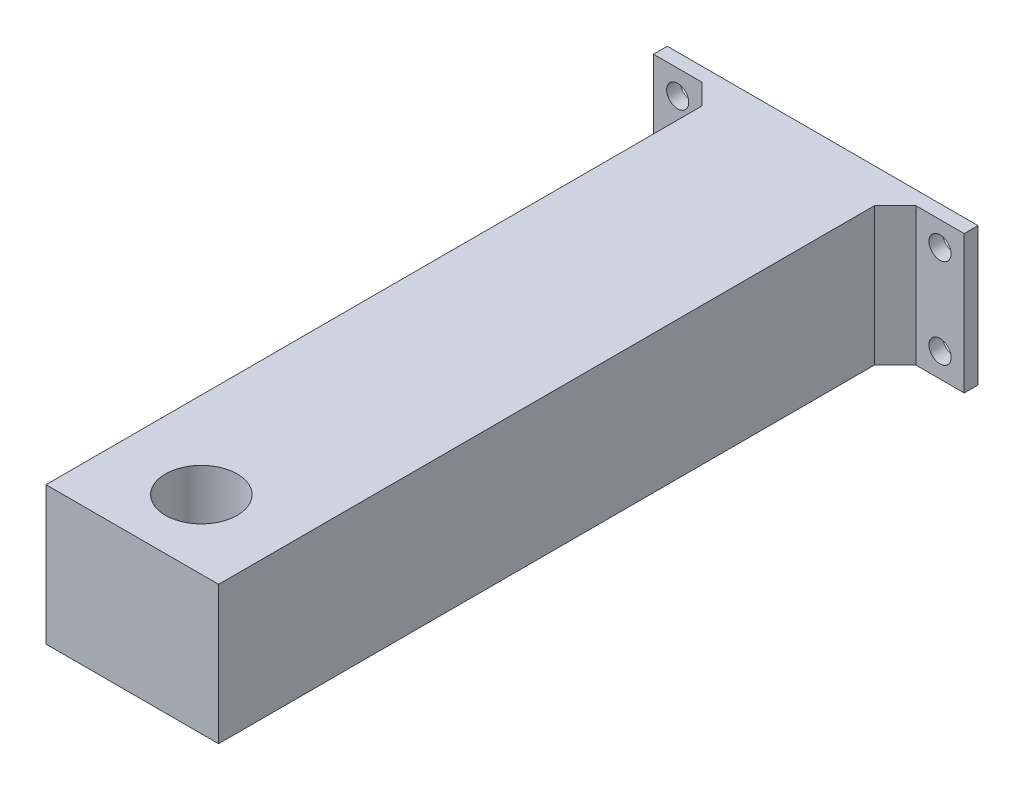
ISO-10303-21;
HEADER;
FILE_DESCRIPTION(('STEP AP214'),'2;1');
FILE_NAME('part.step','',(''),(''),'','','');
FILE_SCHEMA(('AUTOMOTIVE_DESIGN { 1 0 10303 214 1 1 1 1 }'));
ENDSEC;
DATA;
#1=APPLICATION_CONTEXT('core data for automotive mechanical design processes');
#2=APPLICATION_PROTOCOL_DEFINITION('international standard','automotive_design',2000,#1);
#3=PRODUCT_CONTEXT('',#1,'mechanical');
#4=PRODUCT('Part','Part','',(#3));
#5=PRODUCT_RELATED_PRODUCT_CATEGORY('part','',(#4));
#6=PRODUCT_DEFINITION_FORMATION('','',#4);
#7=PRODUCT_DEFINITION_CONTEXT('part definition',#1,'design');
#8=PRODUCT_DEFINITION('design','',#6,#7);
#9=PRODUCT_DEFINITION_SHAPE('','',#8);
#10=(LENGTH_UNIT() NAMED_UNIT(*) SI_UNIT(.MILLI.,.METRE.));
#11=(NAMED_UNIT(*) PLANE_ANGLE_UNIT() SI_UNIT($,.RADIAN.));
#12=(NAMED_UNIT(*) SI_UNIT($,.STERADIAN.) SOLID_ANGLE_UNIT());
#13=UNCERTAINTY_MEASURE_WITH_UNIT(LENGTH_MEASURE(1.E-05),#10,'distance_accuracy_value','');
#14=(GEOMETRIC_REPRESENTATION_CONTEXT(3) GLOBAL_UNCERTAINTY_ASSIGNED_CONTEXT((#13)) GLOBAL_UNIT_ASSIGNED_CONTEXT((#10,
#11,#12)) REPRESENTATION_CONTEXT('',''));
#15=CARTESIAN_POINT('',(0.,0.,0.));
#16=DIRECTION('',(0.,0.,1.));
#17=DIRECTION('',(1.,0.,0.));
#18=AXIS2_PLACEMENT_3D('',#15,#16,#17);
#19=CARTESIAN_POINT('',(-12.7289446195248,5.19153225806452,100.));
#20=DIRECTION('',(1.,0.,0.));
#21=DIRECTION('',(0.,0.,-1.));
#22=AXIS2_PLACEMENT_3D('',#19,#20,#21);
#23=PLANE('',#22);
#24=DIRECTION('',(0.,0.,-1.));
#25=VECTOR('',#24,1.);
#26=CARTESIAN_POINT('',(-12.7289446195248,5.19153225806452,100.));
#27=LINE('',#26,#25);
#28=CARTESIAN_POINT('',(-12.7289446195248,5.19153225806452,100.));
#29=VERTEX_POINT('',#28);
#30=CARTESIAN_POINT('',(-12.7289446195248,5.19153225806452,5.));
#31=VERTEX_POINT('',#30);
#32=EDGE_CURVE('E51',#29,#31,#27,.T.);
#33=ORIENTED_EDGE('',*,*,#32,.T.);
#34=DIRECTION('',(0.,-1.,0.));
#35=VECTOR('',#34,1.);
#36=CARTESIAN_POINT('',(-12.7289446195248,5.19153225806452,5.));
#37=LINE('',#36,#35);
#38=CARTESIAN_POINT('',(-12.7289446195248,-14.8084677419355,5.));
#39=VERTEX_POINT('',#38);
#40=EDGE_CURVE('E47',#31,#39,#37,.T.);
#41=ORIENTED_EDGE('',*,*,#40,.T.);
#42=DIRECTION('',(0.,0.,-1.));
#43=VECTOR('',#42,1.);
#44=CARTESIAN_POINT('',(-12.7289446195248,-14.8084677419355,100.));
#45=LINE('',#44,#43);
#46=CARTESIAN_POINT('',(-12.7289446195248,-14.8084677419355,100.));
#47=VERTEX_POINT('',#46);
#48=EDGE_CURVE('E11',#47,#39,#45,.T.);
#49=ORIENTED_EDGE('',*,*,#48,.F.);
#50=DIRECTION('',(0.,-1.,0.));
#51=VECTOR('',#50,1.);
#52=CARTESIAN_POINT('',(-12.7289446195248,5.19153225806452,100.));
#53=LINE('',#52,#51);
#54=EDGE_CURVE('E186',#29,#47,#53,.T.);
#55=ORIENTED_EDGE('',*,*,#54,.F.);
#56=EDGE_LOOP('',(#33,#41,#49,#55));
#57=FACE_BOUND('',#56,.T.);
#58=ADVANCED_FACE('F33',(#57),#23,.F.);
#59=CARTESIAN_POINT('',(12.2710553804752,5.19153225806452,100.));
#60=DIRECTION('',(-1.,0.,0.));
#61=DIRECTION('',(0.,-1.,0.));
#62=AXIS2_PLACEMENT_3D('',#59,#60,#61);
#63=PLANE('',#62);
#64=DIRECTION('',(0.,0.,-1.));
#65=VECTOR('',#64,1.);
#66=CARTESIAN_POINT('',(12.2710553804752,-14.8084677419355,100.));
#67=LINE('',#66,#65);
#68=CARTESIAN_POINT('',(12.2710553804752,-14.8084677419355,100.));
#69=VERTEX_POINT('',#68);
#70=CARTESIAN_POINT('',(12.2710553804752,-14.8084677419355,5.));
#71=VERTEX_POINT('',#70);
#72=EDGE_CURVE('E40',#69,#71,#67,.T.);
#73=ORIENTED_EDGE('',*,*,#72,.T.);
#74=DIRECTION('',(0.,1.,0.));
#75=VECTOR('',#74,1.);
#76=CARTESIAN_POINT('',(12.2710553804752,-14.8084677419355,5.));
#77=LINE('',#76,#75);
#78=CARTESIAN_POINT('',(12.2710553804752,5.19153225806452,5.));
#79=VERTEX_POINT('',#78);
#80=EDGE_CURVE('E162',#71,#79,#77,.T.);
#81=ORIENTED_EDGE('',*,*,#80,.T.);
#82=DIRECTION('',(0.,0.,-1.));
#83=VECTOR('',#82,1.);
#84=CARTESIAN_POINT('',(12.2710553804752,5.19153225806452,100.));
#85=LINE('',#84,#83);
#86=CARTESIAN_POINT('',(12.2710553804752,5.19153225806452,100.));
#87=VERTEX_POINT('',#86);
#88=EDGE_CURVE('E197',#87,#79,#85,.T.);
#89=ORIENTED_EDGE('',*,*,#88,.F.);
#90=DIRECTION('',(0.,1.,0.));
#91=VECTOR('',#90,1.);
#92=CARTESIAN_POINT('',(12.2710553804752,5.19153225806452,100.));
#93=LINE('',#92,#91);
#94=EDGE_CURVE('E191',#69,#87,#93,.T.);
#95=ORIENTED_EDGE('',*,*,#94,.F.);
#96=EDGE_LOOP('',(#73,#81,#89,#95));
#97=FACE_BOUND('',#96,.T.);
#98=ADVANCED_FACE('F203',(#97),#63,.F.);
#99=CARTESIAN_POINT('',(-12.7289446195248,-14.8084677419355,100.));
#100=DIRECTION('',(0.,1.,0.));
#101=DIRECTION('',(0.,0.,1.));
#102=AXIS2_PLACEMENT_3D('',#99,#100,#101);
#103=PLANE('',#102);
#104=ORIENTED_EDGE('',*,*,#48,.T.);
#105=DIRECTION('',(-0.707106781186548,0.,-0.707106781186547));
#106=VECTOR('',#105,1.);
#107=CARTESIAN_POINT('',(-12.7289446195248,-14.8084677419355,5.));
#108=LINE('',#107,#106);
#109=CARTESIAN_POINT('',(-15.7289446195248,-14.8084677419355,2.));
#110=VERTEX_POINT('',#109);
#111=EDGE_CURVE('E223',#39,#110,#108,.T.);
#112=ORIENTED_EDGE('',*,*,#111,.T.);
#113=DIRECTION('',(1.,0.,0.));
#114=VECTOR('',#113,1.);
#115=CARTESIAN_POINT('',(-22.7289446195248,-14.8084677419355,2.));
#116=LINE('',#115,#114);
#117=CARTESIAN_POINT('',(-22.7289446195248,-14.8084677419355,2.));
#118=VERTEX_POINT('',#117);
#119=EDGE_CURVE('E125',#118,#110,#116,.T.);
#120=ORIENTED_EDGE('',*,*,#119,.F.);
#121=DIRECTION('',(0.,0.,1.));
#122=VECTOR('',#121,1.);
#123=CARTESIAN_POINT('',(-22.7289446195248,-14.8084677419355,0.));
#124=LINE('',#123,#122);
#125=CARTESIAN_POINT('',(-22.7289446195248,-14.8084677419355,0.));
#126=VERTEX_POINT('',#125);
#127=EDGE_CURVE('E122',#126,#118,#124,.T.);
#128=ORIENTED_EDGE('',*,*,#127,.F.);
#129=DIRECTION('',(1.,0.,0.));
#130=VECTOR('',#129,1.);
#131=CARTESIAN_POINT('',(-12.7289446195248,-14.8084677419355,0.));
#132=LINE('',#131,#130);
#133=CARTESIAN_POINT('',(22.2710553804752,-14.8084677419355,0.));
#134=VERTEX_POINT('',#133);
#135=EDGE_CURVE('E108',#126,#134,#132,.T.);
#136=ORIENTED_EDGE('',*,*,#135,.T.);
#137=DIRECTION('',(0.,0.,-1.));
#138=VECTOR('',#137,1.);
#139=CARTESIAN_POINT('',(22.2710553804752,-14.8084677419355,0.));
#140=LINE('',#139,#138);
#141=CARTESIAN_POINT('',(22.2710553804752,-14.8084677419355,2.));
#142=VERTEX_POINT('',#141);
#143=EDGE_CURVE('E174',#142,#134,#140,.T.);
#144=ORIENTED_EDGE('',*,*,#143,.F.);
#145=DIRECTION('',(-1.,0.,0.));
#146=VECTOR('',#145,1.);
#147=CARTESIAN_POINT('',(22.2710553804752,-14.8084677419355,2.));
#148=LINE('',#147,#146);
#149=CARTESIAN_POINT('',(15.2710553804752,-14.8084677419355,2.));
#150=VERTEX_POINT('',#149);
#151=EDGE_CURVE('E176',#142,#150,#148,.T.);
#152=ORIENTED_EDGE('',*,*,#151,.T.);
#153=DIRECTION('',(0.707106781186547,0.,-0.707106781186548));
#154=VECTOR('',#153,1.);
#155=CARTESIAN_POINT('',(12.2710553804752,-14.8084677419355,5.));
#156=LINE('',#155,#154);
#157=EDGE_CURVE('E159',#71,#150,#156,.T.);
#158=ORIENTED_EDGE('',*,*,#157,.F.);
#159=ORIENTED_EDGE('',*,*,#72,.F.);
#160=DIRECTION('',(1.,0.,0.));
#161=VECTOR('',#160,1.);
#162=CARTESIAN_POINT('',(-12.7289446195248,-14.8084677419355,100.));
#163=LINE('',#162,#161);
#164=EDGE_CURVE('E189',#47,#69,#163,.T.);
#165=ORIENTED_EDGE('',*,*,#164,.F.);
#166=EDGE_LOOP('',(#104,#112,#120,#128,#136,#144,#152,#158,#159,#165));
#167=FACE_BOUND('',#166,.T.);
#168=ADVANCED_FACE('F123',(#167),#103,.F.);
#169=CARTESIAN_POINT('',(-12.7289446195248,5.19153225806452,100.));
#170=DIRECTION('',(0.,-1.,0.));
#171=DIRECTION('',(0.,0.,-1.));
#172=AXIS2_PLACEMENT_3D('',#169,#170,#171);
#173=PLANE('',#172);
#174=DIRECTION('',(-0.707106781186548,0.,-0.707106781186547));
#175=VECTOR('',#174,1.);
#176=CARTESIAN_POINT('',(-12.7289446195248,5.19153225806452,5.));
#177=LINE('',#176,#175);
#178=CARTESIAN_POINT('',(-15.7289446195248,5.19153225806452,2.));
#179=VERTEX_POINT('',#178);
#180=EDGE_CURVE('E227',#31,#179,#177,.T.);
#181=ORIENTED_EDGE('',*,*,#180,.F.);
#182=ORIENTED_EDGE('',*,*,#32,.F.);
#183=DIRECTION('',(-1.,0.,0.));
#184=VECTOR('',#183,1.);
#185=CARTESIAN_POINT('',(-12.7289446195248,5.19153225806452,100.));
#186=LINE('',#185,#184);
#187=EDGE_CURVE('E193',#87,#29,#186,.T.);
#188=ORIENTED_EDGE('',*,*,#187,.F.);
#189=ORIENTED_EDGE('',*,*,#88,.T.);
#190=DIRECTION('',(0.707106781186547,0.,-0.707106781186548));
#191=VECTOR('',#190,1.);
#192=CARTESIAN_POINT('',(12.2710553804752,5.19153225806452,5.));
#193=LINE('',#192,#191);
#194=CARTESIAN_POINT('',(15.2710553804752,5.19153225806452,2.));
#195=VERTEX_POINT('',#194);
#196=EDGE_CURVE('E156',#79,#195,#193,.T.);
#197=ORIENTED_EDGE('',*,*,#196,.T.);
#198=DIRECTION('',(-1.,0.,0.));
#199=VECTOR('',#198,1.);
#200=CARTESIAN_POINT('',(22.2710553804752,5.19153225806452,2.));
#201=LINE('',#200,#199);
#202=CARTESIAN_POINT('',(22.2710553804752,5.19153225806452,2.));
#203=VERTEX_POINT('',#202);
#204=EDGE_CURVE('E179',#203,#195,#201,.T.);
#205=ORIENTED_EDGE('',*,*,#204,.F.);
#206=DIRECTION('',(0.,0.,1.));
#207=VECTOR('',#206,1.);
#208=CARTESIAN_POINT('',(22.2710553804752,5.19153225806452,0.));
#209=LINE('',#208,#207);
#210=CARTESIAN_POINT('',(22.2710553804752,5.19153225806452,0.));
#211=VERTEX_POINT('',#210);
#212=EDGE_CURVE('E170',#211,#203,#209,.T.);
#213=ORIENTED_EDGE('',*,*,#212,.F.);
#214=DIRECTION('',(-1.,0.,0.));
#215=VECTOR('',#214,1.);
#216=CARTESIAN_POINT('',(-12.7289446195248,5.19153225806452,0.));
#217=LINE('',#216,#215);
#218=CARTESIAN_POINT('',(-22.7289446195248,5.19153225806452,0.));
#219=VERTEX_POINT('',#218);
#220=EDGE_CURVE('E118',#211,#219,#217,.T.);
#221=ORIENTED_EDGE('',*,*,#220,.T.);
#222=DIRECTION('',(0.,0.,-1.));
#223=VECTOR('',#222,1.);
#224=CARTESIAN_POINT('',(-22.7289446195248,5.19153225806452,0.));
#225=LINE('',#224,#223);
#226=CARTESIAN_POINT('',(-22.7289446195248,5.19153225806452,2.));
#227=VERTEX_POINT('',#226);
#228=EDGE_CURVE('E133',#227,#219,#225,.T.);
#229=ORIENTED_EDGE('',*,*,#228,.F.);
#230=DIRECTION('',(1.,0.,0.));
#231=VECTOR('',#230,1.);
#232=CARTESIAN_POINT('',(-22.7289446195248,5.19153225806452,2.));
#233=LINE('',#232,#231);
#234=EDGE_CURVE('E142',#227,#179,#233,.T.);
#235=ORIENTED_EDGE('',*,*,#234,.T.);
#236=EDGE_LOOP('',(#181,#182,#188,#189,#197,#205,#213,#221,#229,#235));
#237=FACE_BOUND('',#236,.T.);
#238=CARTESIAN_POINT('',(-0.228944619524789,5.19153225806452,90.));
#239=DIRECTION('',(0.,1.,0.));
#240=DIRECTION('',(0.,0.,1.));
#241=AXIS2_PLACEMENT_3D('',#238,#239,#240);
#242=CIRCLE('',#241,5.2);
#243=CARTESIAN_POINT('',(-0.228944619524789,5.19153225806452,95.2));
#244=VERTEX_POINT('',#243);
#245=EDGE_CURVE('E181',#244,#244,#242,.T.);
#246=ORIENTED_EDGE('',*,*,#245,.F.);
#247=EDGE_LOOP('',(#246));
#248=FACE_BOUND('',#247,.T.);
#249=ADVANCED_FACE('F216',(#237,#248),#173,.F.);
#250=CARTESIAN_POINT('',(0.,0.,100.));
#251=DIRECTION('',(0.,0.,1.));
#252=DIRECTION('',(1.,0.,0.));
#253=AXIS2_PLACEMENT_3D('',#250,#251,#252);
#254=PLANE('',#253);
#255=ORIENTED_EDGE('',*,*,#54,.T.);
#256=ORIENTED_EDGE('',*,*,#164,.T.);
#257=ORIENTED_EDGE('',*,*,#94,.T.);
#258=ORIENTED_EDGE('',*,*,#187,.T.);
#259=EDGE_LOOP('',(#255,#256,#257,#258));
#260=FACE_BOUND('',#259,.T.);
#261=ADVANCED_FACE('F221',(#260),#254,.T.);
#262=CARTESIAN_POINT('',(0.,0.,0.));
#263=DIRECTION('',(0.,0.,1.));
#264=DIRECTION('',(1.,0.,0.));
#265=AXIS2_PLACEMENT_3D('',#262,#263,#264);
#266=PLANE('',#265);
#267=CARTESIAN_POINT('',(-19.2289446195248,1.69153225806452,0.));
#268=DIRECTION('',(0.,0.,1.));
#269=DIRECTION('',(1.,0.,0.));
#270=AXIS2_PLACEMENT_3D('',#267,#268,#269);
#271=CIRCLE('',#270,1.6);
#272=CARTESIAN_POINT('',(-17.6289446195248,1.69153225806452,0.));
#273=VERTEX_POINT('',#272);
#274=EDGE_CURVE('E236',#273,#273,#271,.T.);
#275=ORIENTED_EDGE('',*,*,#274,.T.);
#276=EDGE_LOOP('',(#275));
#277=FACE_BOUND('',#276,.T.);
#278=CARTESIAN_POINT('',(-19.2289446195248,-11.3084677419355,0.));
#279=DIRECTION('',(0.,0.,1.));
#280=DIRECTION('',(1.,0.,0.));
#281=AXIS2_PLACEMENT_3D('',#278,#279,#280);
#282=CIRCLE('',#281,1.6);
#283=CARTESIAN_POINT('',(-17.6289446195248,-11.3084677419355,0.));
#284=VERTEX_POINT('',#283);
#285=EDGE_CURVE('E228',#284,#284,#282,.T.);
#286=ORIENTED_EDGE('',*,*,#285,.T.);
#287=EDGE_LOOP('',(#286));
#288=FACE_BOUND('',#287,.T.);
#289=CARTESIAN_POINT('',(18.7710553804752,-11.3084677419355,0.));
#290=DIRECTION('',(0.,0.,1.));
#291=DIRECTION('',(1.,0.,0.));
#292=AXIS2_PLACEMENT_3D('',#289,#290,#291);
#293=CIRCLE('',#292,1.6);
#294=CARTESIAN_POINT('',(20.3710553804752,-11.3084677419355,0.));
#295=VERTEX_POINT('',#294);
#296=EDGE_CURVE('E147',#295,#295,#293,.T.);
#297=ORIENTED_EDGE('',*,*,#296,.T.);
#298=EDGE_LOOP('',(#297));
#299=FACE_BOUND('',#298,.T.);
#300=CARTESIAN_POINT('',(18.7710553804752,1.69153225806452,0.));
#301=DIRECTION('',(0.,0.,1.));
#302=DIRECTION('',(1.,0.,0.));
#303=AXIS2_PLACEMENT_3D('',#300,#301,#302);
#304=CIRCLE('',#303,1.6);
#305=CARTESIAN_POINT('',(20.3710553804752,1.69153225806452,0.));
#306=VERTEX_POINT('',#305);
#307=EDGE_CURVE('E153',#306,#306,#304,.T.);
#308=ORIENTED_EDGE('',*,*,#307,.T.);
#309=EDGE_LOOP('',(#308));
#310=FACE_BOUND('',#309,.T.);
#311=ORIENTED_EDGE('',*,*,#135,.F.);
#312=DIRECTION('',(0.,-1.,0.));
#313=VECTOR('',#312,1.);
#314=CARTESIAN_POINT('',(-22.7289446195248,-14.8084677419355,0.));
#315=LINE('',#314,#313);
#316=EDGE_CURVE('E112',#219,#126,#315,.T.);
#317=ORIENTED_EDGE('',*,*,#316,.F.);
#318=ORIENTED_EDGE('',*,*,#220,.F.);
#319=DIRECTION('',(0.,1.,0.));
#320=VECTOR('',#319,1.);
#321=CARTESIAN_POINT('',(22.2710553804752,5.19153225806452,0.));
#322=LINE('',#321,#320);
#323=EDGE_CURVE('E114',#134,#211,#322,.T.);
#324=ORIENTED_EDGE('',*,*,#323,.F.);
#325=EDGE_LOOP('',(#311,#317,#318,#324));
#326=FACE_BOUND('',#325,.T.);
#327=ADVANCED_FACE('F110',(#277,#288,#299,#310,#326),#266,.F.);
#328=CARTESIAN_POINT('',(-0.228944619524789,-2.80846774193548,90.));
#329=DIRECTION('',(0.,1.,0.));
#330=DIRECTION('',(0.,0.,1.));
#331=AXIS2_PLACEMENT_3D('',#328,#329,#330);
#332=CYLINDRICAL_SURFACE('',#331,5.2);
#333=CARTESIAN_POINT('',(-0.228944619524789,-2.80846774193548,90.));
#334=DIRECTION('',(0.,1.,0.));
#335=DIRECTION('',(0.,0.,1.));
#336=AXIS2_PLACEMENT_3D('',#333,#334,#335);
#337=CIRCLE('',#336,5.2);
#338=CARTESIAN_POINT('',(-0.228944619524789,-2.80846774193548,95.2));
#339=VERTEX_POINT('',#338);
#340=EDGE_CURVE('E119',#339,#339,#337,.T.);
#341=ORIENTED_EDGE('',*,*,#340,.F.);
#342=EDGE_LOOP('',(#341));
#343=FACE_BOUND('',#342,.T.);
#344=ORIENTED_EDGE('',*,*,#245,.T.);
#345=EDGE_LOOP('',(#344));
#346=FACE_BOUND('',#345,.T.);
#347=ADVANCED_FACE('F287',(#343,#346),#332,.F.);
#348=CARTESIAN_POINT('',(-0.228944619524789,-2.80846774193548,90.));
#349=DIRECTION('',(0.,1.,0.));
#350=DIRECTION('',(0.,0.,1.));
#351=AXIS2_PLACEMENT_3D('',#348,#349,#350);
#352=PLANE('',#351);
#353=ORIENTED_EDGE('',*,*,#340,.T.);
#354=EDGE_LOOP('',(#353));
#355=FACE_BOUND('',#354,.T.);
#356=ADVANCED_FACE('F271',(#355),#352,.T.);
#357=CARTESIAN_POINT('',(22.2710553804752,5.19153225806452,2.));
#358=DIRECTION('',(0.,0.,-1.));
#359=DIRECTION('',(0.,1.,0.));
#360=AXIS2_PLACEMENT_3D('',#357,#358,#359);
#361=PLANE('',#360);
#362=CARTESIAN_POINT('',(18.7710553804752,-11.3084677419355,2.));
#363=DIRECTION('',(0.,0.,1.));
#364=DIRECTION('',(1.,0.,0.));
#365=AXIS2_PLACEMENT_3D('',#362,#363,#364);
#366=CIRCLE('',#365,1.6);
#367=CARTESIAN_POINT('',(20.3710553804752,-11.3084677419355,2.));
#368=VERTEX_POINT('',#367);
#369=EDGE_CURVE('E146',#368,#368,#366,.T.);
#370=ORIENTED_EDGE('',*,*,#369,.F.);
#371=EDGE_LOOP('',(#370));
#372=FACE_BOUND('',#371,.T.);
#373=CARTESIAN_POINT('',(18.7710553804752,1.69153225806452,2.));
#374=DIRECTION('',(0.,0.,1.));
#375=DIRECTION('',(1.,0.,0.));
#376=AXIS2_PLACEMENT_3D('',#373,#374,#375);
#377=CIRCLE('',#376,1.6);
#378=CARTESIAN_POINT('',(20.3710553804752,1.69153225806452,2.));
#379=VERTEX_POINT('',#378);
#380=EDGE_CURVE('E150',#379,#379,#377,.T.);
#381=ORIENTED_EDGE('',*,*,#380,.F.);
#382=EDGE_LOOP('',(#381));
#383=FACE_BOUND('',#382,.T.);
#384=ORIENTED_EDGE('',*,*,#204,.T.);
#385=DIRECTION('',(0.,1.,0.));
#386=VECTOR('',#385,1.);
#387=CARTESIAN_POINT('',(15.2710553804752,-14.8084677419355,2.));
#388=LINE('',#387,#386);
#389=EDGE_CURVE('E165',#150,#195,#388,.T.);
#390=ORIENTED_EDGE('',*,*,#389,.F.);
#391=ORIENTED_EDGE('',*,*,#151,.F.);
#392=DIRECTION('',(0.,-1.,0.));
#393=VECTOR('',#392,1.);
#394=CARTESIAN_POINT('',(22.2710553804752,5.19153225806452,2.));
#395=LINE('',#394,#393);
#396=EDGE_CURVE('E172',#203,#142,#395,.T.);
#397=ORIENTED_EDGE('',*,*,#396,.F.);
#398=EDGE_LOOP('',(#384,#390,#391,#397));
#399=FACE_BOUND('',#398,.T.);
#400=ADVANCED_FACE('F212',(#372,#383,#399),#361,.F.);
#401=CARTESIAN_POINT('',(22.2710553804752,0.,0.));
#402=DIRECTION('',(-1.,0.,0.));
#403=DIRECTION('',(0.,-1.,0.));
#404=AXIS2_PLACEMENT_3D('',#401,#402,#403);
#405=PLANE('',#404);
#406=ORIENTED_EDGE('',*,*,#323,.T.);
#407=ORIENTED_EDGE('',*,*,#212,.T.);
#408=ORIENTED_EDGE('',*,*,#396,.T.);
#409=ORIENTED_EDGE('',*,*,#143,.T.);
#410=EDGE_LOOP('',(#406,#407,#408,#409));
#411=FACE_BOUND('',#410,.T.);
#412=ADVANCED_FACE('F262',(#411),#405,.F.);
#413=CARTESIAN_POINT('',(12.2710553804752,-14.8084677419355,5.));
#414=DIRECTION('',(0.707106781186548,0.,0.707106781186547));
#415=DIRECTION('',(0.707106781186547,0.,-0.707106781186548));
#416=AXIS2_PLACEMENT_3D('',#413,#414,#415);
#417=PLANE('',#416);
#418=ORIENTED_EDGE('',*,*,#196,.F.);
#419=ORIENTED_EDGE('',*,*,#80,.F.);
#420=ORIENTED_EDGE('',*,*,#157,.T.);
#421=ORIENTED_EDGE('',*,*,#389,.T.);
#422=EDGE_LOOP('',(#418,#419,#420,#421));
#423=FACE_BOUND('',#422,.T.);
#424=ADVANCED_FACE('F208',(#423),#417,.T.);
#425=CARTESIAN_POINT('',(18.7710553804752,1.69153225806452,0.));
#426=DIRECTION('',(0.,0.,1.));
#427=DIRECTION('',(1.,0.,0.));
#428=AXIS2_PLACEMENT_3D('',#425,#426,#427);
#429=CYLINDRICAL_SURFACE('',#428,1.6);
#430=ORIENTED_EDGE('',*,*,#307,.F.);
#431=EDGE_LOOP('',(#430));
#432=FACE_BOUND('',#431,.T.);
#433=ORIENTED_EDGE('',*,*,#380,.T.);
#434=EDGE_LOOP('',(#433));
#435=FACE_BOUND('',#434,.T.);
#436=ADVANCED_FACE('F269',(#432,#435),#429,.F.);
#437=CARTESIAN_POINT('',(18.7710553804752,-11.3084677419355,0.));
#438=DIRECTION('',(0.,0.,1.));
#439=DIRECTION('',(1.,0.,0.));
#440=AXIS2_PLACEMENT_3D('',#437,#438,#439);
#441=CYLINDRICAL_SURFACE('',#440,1.6);
#442=ORIENTED_EDGE('',*,*,#296,.F.);
#443=EDGE_LOOP('',(#442));
#444=FACE_BOUND('',#443,.T.);
#445=ORIENTED_EDGE('',*,*,#369,.T.);
#446=EDGE_LOOP('',(#445));
#447=FACE_BOUND('',#446,.T.);
#448=ADVANCED_FACE('F256',(#444,#447),#441,.F.);
#449=CARTESIAN_POINT('',(-22.7289446195248,-14.8084677419355,2.));
#450=DIRECTION('',(0.,0.,-1.));
#451=DIRECTION('',(0.,1.,0.));
#452=AXIS2_PLACEMENT_3D('',#449,#450,#451);
#453=PLANE('',#452);
#454=CARTESIAN_POINT('',(-19.2289446195248,1.69153225806452,2.));
#455=DIRECTION('',(0.,0.,1.));
#456=DIRECTION('',(1.,0.,0.));
#457=AXIS2_PLACEMENT_3D('',#454,#455,#456);
#458=CIRCLE('',#457,1.6);
#459=CARTESIAN_POINT('',(-17.6289446195248,1.69153225806452,2.));
#460=VERTEX_POINT('',#459);
#461=EDGE_CURVE('E238',#460,#460,#458,.T.);
#462=ORIENTED_EDGE('',*,*,#461,.F.);
#463=EDGE_LOOP('',(#462));
#464=FACE_BOUND('',#463,.T.);
#465=CARTESIAN_POINT('',(-19.2289446195248,-11.3084677419355,2.));
#466=DIRECTION('',(0.,0.,1.));
#467=DIRECTION('',(1.,0.,0.));
#468=AXIS2_PLACEMENT_3D('',#465,#466,#467);
#469=CIRCLE('',#468,1.6);
#470=CARTESIAN_POINT('',(-17.6289446195248,-11.3084677419355,2.));
#471=VERTEX_POINT('',#470);
#472=EDGE_CURVE('E232',#471,#471,#469,.T.);
#473=ORIENTED_EDGE('',*,*,#472,.F.);
#474=EDGE_LOOP('',(#473));
#475=FACE_BOUND('',#474,.T.);
#476=ORIENTED_EDGE('',*,*,#119,.T.);
#477=DIRECTION('',(0.,-1.,0.));
#478=VECTOR('',#477,1.);
#479=CARTESIAN_POINT('',(-15.7289446195248,5.19153225806452,2.));
#480=LINE('',#479,#478);
#481=EDGE_CURVE('E134',#179,#110,#480,.T.);
#482=ORIENTED_EDGE('',*,*,#481,.F.);
#483=ORIENTED_EDGE('',*,*,#234,.F.);
#484=DIRECTION('',(0.,1.,0.));
#485=VECTOR('',#484,1.);
#486=CARTESIAN_POINT('',(-22.7289446195248,-14.8084677419355,2.));
#487=LINE('',#486,#485);
#488=EDGE_CURVE('E128',#118,#227,#487,.T.);
#489=ORIENTED_EDGE('',*,*,#488,.F.);
#490=EDGE_LOOP('',(#476,#482,#483,#489));
#491=FACE_BOUND('',#490,.T.);
#492=ADVANCED_FACE('F253',(#464,#475,#491),#453,.F.);
#493=CARTESIAN_POINT('',(-22.7289446195248,0.,0.));
#494=DIRECTION('',(1.,0.,0.));
#495=DIRECTION('',(0.,0.,-1.));
#496=AXIS2_PLACEMENT_3D('',#493,#494,#495);
#497=PLANE('',#496);
#498=ORIENTED_EDGE('',*,*,#316,.T.);
#499=ORIENTED_EDGE('',*,*,#127,.T.);
#500=ORIENTED_EDGE('',*,*,#488,.T.);
#501=ORIENTED_EDGE('',*,*,#228,.T.);
#502=EDGE_LOOP('',(#498,#499,#500,#501));
#503=FACE_BOUND('',#502,.T.);
#504=ADVANCED_FACE('F131',(#503),#497,.F.);
#505=CARTESIAN_POINT('',(-12.7289446195248,5.19153225806452,5.));
#506=DIRECTION('',(-0.707106781186547,0.,0.707106781186548));
#507=DIRECTION('',(0.707106781186548,0.,0.707106781186547));
#508=AXIS2_PLACEMENT_3D('',#505,#506,#507);
#509=PLANE('',#508);
#510=ORIENTED_EDGE('',*,*,#111,.F.);
#511=ORIENTED_EDGE('',*,*,#40,.F.);
#512=ORIENTED_EDGE('',*,*,#180,.T.);
#513=ORIENTED_EDGE('',*,*,#481,.T.);
#514=EDGE_LOOP('',(#510,#511,#512,#513));
#515=FACE_BOUND('',#514,.T.);
#516=ADVANCED_FACE('F225',(#515),#509,.T.);
#517=CARTESIAN_POINT('',(-19.2289446195248,-11.3084677419355,0.));
#518=DIRECTION('',(0.,0.,1.));
#519=DIRECTION('',(1.,0.,0.));
#520=AXIS2_PLACEMENT_3D('',#517,#518,#519);
#521=CYLINDRICAL_SURFACE('',#520,1.6);
#522=ORIENTED_EDGE('',*,*,#285,.F.);
#523=EDGE_LOOP('',(#522));
#524=FACE_BOUND('',#523,.T.);
#525=ORIENTED_EDGE('',*,*,#472,.T.);
#526=EDGE_LOOP('',(#525));
#527=FACE_BOUND('',#526,.T.);
#528=ADVANCED_FACE('F249',(#524,#527),#521,.F.);
#529=CARTESIAN_POINT('',(-19.2289446195248,1.69153225806452,0.));
#530=DIRECTION('',(0.,0.,1.));
#531=DIRECTION('',(1.,0.,0.));
#532=AXIS2_PLACEMENT_3D('',#529,#530,#531);
#533=CYLINDRICAL_SURFACE('',#532,1.6);
#534=ORIENTED_EDGE('',*,*,#274,.F.);
#535=EDGE_LOOP('',(#534));
#536=FACE_BOUND('',#535,.T.);
#537=ORIENTED_EDGE('',*,*,#461,.T.);
#538=EDGE_LOOP('',(#537));
#539=FACE_BOUND('',#538,.T.);
#540=ADVANCED_FACE('F246',(#536,#539),#533,.F.);
#541=CLOSED_SHELL('',(#58,#98,#168,#249,#261,#327,#347,#356,#400,#412,#424,#436,#448,#492,#504,
#516,#528,#540));
#542=MANIFOLD_SOLID_BREP('B2',#541);
#543=ADVANCED_BREP_SHAPE_REPRESENTATION('',(#18,#542),#14);
#544=SHAPE_DEFINITION_REPRESENTATION(#9,#543);
ENDSEC;
END-ISO-10303-21;
